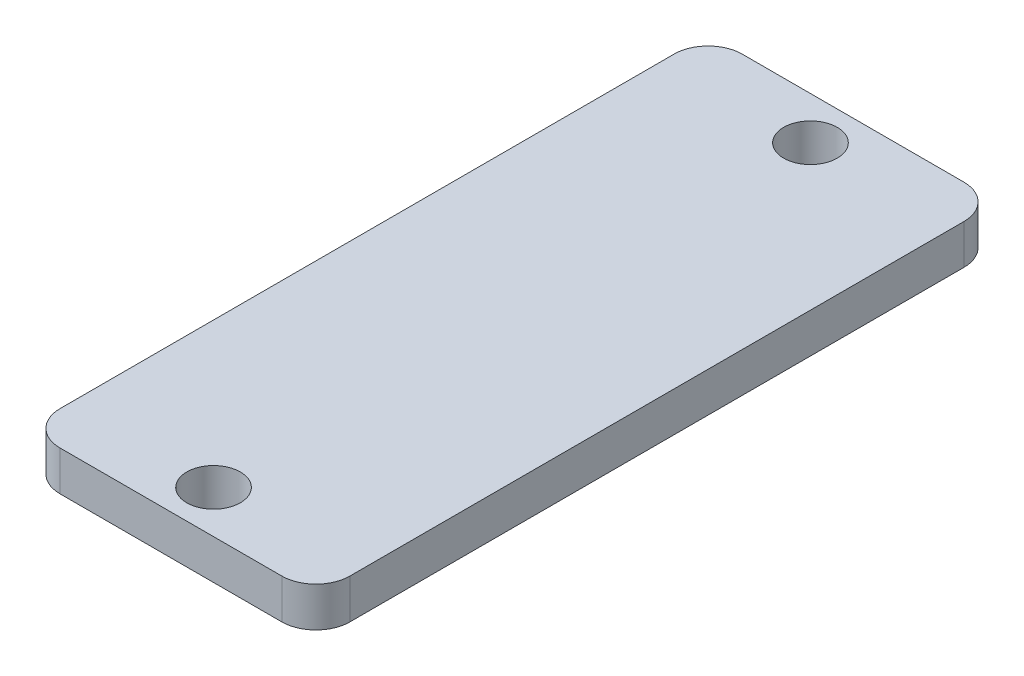
ISO-10303-21;
HEADER;
FILE_DESCRIPTION(('STEP AP214'),'2;1');
FILE_NAME('part.step','',(''),(''),'','','');
FILE_SCHEMA(('AUTOMOTIVE_DESIGN { 1 0 10303 214 1 1 1 1 }'));
ENDSEC;
DATA;
#1=APPLICATION_CONTEXT('core data for automotive mechanical design processes');
#2=APPLICATION_PROTOCOL_DEFINITION('international standard','automotive_design',2000,#1);
#3=PRODUCT_CONTEXT('',#1,'mechanical');
#4=PRODUCT('Part','Part','',(#3));
#5=PRODUCT_RELATED_PRODUCT_CATEGORY('part','',(#4));
#6=PRODUCT_DEFINITION_FORMATION('','',#4);
#7=PRODUCT_DEFINITION_CONTEXT('part definition',#1,'design');
#8=PRODUCT_DEFINITION('design','',#6,#7);
#9=PRODUCT_DEFINITION_SHAPE('','',#8);
#10=(LENGTH_UNIT() NAMED_UNIT(*) SI_UNIT(.MILLI.,.METRE.));
#11=(NAMED_UNIT(*) PLANE_ANGLE_UNIT() SI_UNIT($,.RADIAN.));
#12=(NAMED_UNIT(*) SI_UNIT($,.STERADIAN.) SOLID_ANGLE_UNIT());
#13=UNCERTAINTY_MEASURE_WITH_UNIT(LENGTH_MEASURE(1.E-05),#10,'distance_accuracy_value','');
#14=(GEOMETRIC_REPRESENTATION_CONTEXT(3) GLOBAL_UNCERTAINTY_ASSIGNED_CONTEXT((#13)) GLOBAL_UNIT_ASSIGNED_CONTEXT((#10,
#11,#12)) REPRESENTATION_CONTEXT('',''));
#15=CARTESIAN_POINT('',(0.,0.,0.));
#16=DIRECTION('',(0.,0.,1.));
#17=DIRECTION('',(1.,0.,0.));
#18=AXIS2_PLACEMENT_3D('',#15,#16,#17);
#19=CARTESIAN_POINT('',(0.,2.9591,0.));
#20=DIRECTION('',(0.,-1.,0.));
#21=DIRECTION('',(0.,0.,-1.));
#22=AXIS2_PLACEMENT_3D('',#19,#20,#21);
#23=PLANE('',#22);
#24=CARTESIAN_POINT('',(0.,2.9591,-22.225));
#25=DIRECTION('',(0.,1.,0.));
#26=DIRECTION('',(0.,0.,1.));
#27=AXIS2_PLACEMENT_3D('',#24,#25,#26);
#28=CIRCLE('',#27,1.9939);
#29=CARTESIAN_POINT('',(0.,2.9591,-20.2311));
#30=VERTEX_POINT('',#29);
#31=EDGE_CURVE('E132',#30,#30,#28,.T.);
#32=ORIENTED_EDGE('',*,*,#31,.F.);
#33=EDGE_LOOP('',(#32));
#34=FACE_BOUND('',#33,.T.);
#35=DIRECTION('',(0.,0.,-1.));
#36=VECTOR('',#35,1.);
#37=CARTESIAN_POINT('',(10.795,2.9591,25.4));
#38=LINE('',#37,#36);
#39=CARTESIAN_POINT('',(10.795,2.9591,22.86));
#40=VERTEX_POINT('',#39);
#41=CARTESIAN_POINT('',(10.795,2.9591,-22.86));
#42=VERTEX_POINT('',#41);
#43=EDGE_CURVE('E137',#40,#42,#38,.T.);
#44=ORIENTED_EDGE('',*,*,#43,.T.);
#45=CARTESIAN_POINT('',(8.255,2.9591,-22.86));
#46=DIRECTION('',(0.,-1.,0.));
#47=DIRECTION('',(0.,0.,-1.));
#48=AXIS2_PLACEMENT_3D('',#45,#46,#47);
#49=CIRCLE('',#48,2.54);
#50=CARTESIAN_POINT('',(8.255,2.9591,-25.4));
#51=VERTEX_POINT('',#50);
#52=EDGE_CURVE('E152',#42,#51,#49,.F.);
#53=ORIENTED_EDGE('',*,*,#52,.T.);
#54=DIRECTION('',(-1.,0.,0.));
#55=VECTOR('',#54,1.);
#56=CARTESIAN_POINT('',(-10.795,2.9591,-25.4));
#57=LINE('',#56,#55);
#58=CARTESIAN_POINT('',(-8.255,2.9591,-25.4));
#59=VERTEX_POINT('',#58);
#60=EDGE_CURVE('E119',#51,#59,#57,.T.);
#61=ORIENTED_EDGE('',*,*,#60,.T.);
#62=CARTESIAN_POINT('',(-8.255,2.9591,-22.86));
#63=DIRECTION('',(0.,-1.,0.));
#64=DIRECTION('',(0.,0.,-1.));
#65=AXIS2_PLACEMENT_3D('',#62,#63,#64);
#66=CIRCLE('',#65,2.54);
#67=CARTESIAN_POINT('',(-10.795,2.9591,-22.86));
#68=VERTEX_POINT('',#67);
#69=EDGE_CURVE('E150',#59,#68,#66,.F.);
#70=ORIENTED_EDGE('',*,*,#69,.T.);
#71=DIRECTION('',(0.,0.,1.));
#72=VECTOR('',#71,1.);
#73=CARTESIAN_POINT('',(-10.795,2.9591,25.4));
#74=LINE('',#73,#72);
#75=CARTESIAN_POINT('',(-10.795,2.9591,22.86));
#76=VERTEX_POINT('',#75);
#77=EDGE_CURVE('E163',#68,#76,#74,.T.);
#78=ORIENTED_EDGE('',*,*,#77,.T.);
#79=CARTESIAN_POINT('',(-8.255,2.9591,22.86));
#80=DIRECTION('',(0.,-1.,0.));
#81=DIRECTION('',(0.,0.,-1.));
#82=AXIS2_PLACEMENT_3D('',#79,#80,#81);
#83=CIRCLE('',#82,2.54);
#84=CARTESIAN_POINT('',(-8.255,2.9591,25.4));
#85=VERTEX_POINT('',#84);
#86=EDGE_CURVE('E54',#76,#85,#83,.F.);
#87=ORIENTED_EDGE('',*,*,#86,.T.);
#88=DIRECTION('',(1.,0.,0.));
#89=VECTOR('',#88,1.);
#90=CARTESIAN_POINT('',(-10.795,2.9591,25.4));
#91=LINE('',#90,#89);
#92=CARTESIAN_POINT('',(8.255,2.9591,25.4));
#93=VERTEX_POINT('',#92);
#94=EDGE_CURVE('E138',#85,#93,#91,.T.);
#95=ORIENTED_EDGE('',*,*,#94,.T.);
#96=CARTESIAN_POINT('',(8.255,2.9591,22.86));
#97=DIRECTION('',(0.,-1.,0.));
#98=DIRECTION('',(0.,0.,-1.));
#99=AXIS2_PLACEMENT_3D('',#96,#97,#98);
#100=CIRCLE('',#99,2.54);
#101=EDGE_CURVE('E147',#93,#40,#100,.F.);
#102=ORIENTED_EDGE('',*,*,#101,.T.);
#103=EDGE_LOOP('',(#44,#53,#61,#70,#78,#87,#95,#102));
#104=FACE_BOUND('',#103,.T.);
#105=CARTESIAN_POINT('',(0.,2.9591,22.225));
#106=DIRECTION('',(0.,1.,0.));
#107=DIRECTION('',(0.,0.,1.));
#108=AXIS2_PLACEMENT_3D('',#105,#106,#107);
#109=CIRCLE('',#108,1.9939);
#110=CARTESIAN_POINT('',(0.,2.9591,24.2189));
#111=VERTEX_POINT('',#110);
#112=EDGE_CURVE('E180',#111,#111,#109,.T.);
#113=ORIENTED_EDGE('',*,*,#112,.F.);
#114=EDGE_LOOP('',(#113));
#115=FACE_BOUND('',#114,.T.);
#116=ADVANCED_FACE('F33',(#34,#104,#115),#23,.F.);
#117=CARTESIAN_POINT('',(0.,0.,0.));
#118=DIRECTION('',(0.,-1.,0.));
#119=DIRECTION('',(0.,0.,-1.));
#120=AXIS2_PLACEMENT_3D('',#117,#118,#119);
#121=PLANE('',#120);
#122=CARTESIAN_POINT('',(0.,0.,-22.225));
#123=DIRECTION('',(0.,1.,0.));
#124=DIRECTION('',(0.,0.,1.));
#125=AXIS2_PLACEMENT_3D('',#122,#123,#124);
#126=CIRCLE('',#125,1.9939);
#127=CARTESIAN_POINT('',(0.,0.,-20.2311));
#128=VERTEX_POINT('',#127);
#129=EDGE_CURVE('E177',#128,#128,#126,.T.);
#130=ORIENTED_EDGE('',*,*,#129,.T.);
#131=EDGE_LOOP('',(#130));
#132=FACE_BOUND('',#131,.T.);
#133=DIRECTION('',(-1.,0.,0.));
#134=VECTOR('',#133,1.);
#135=CARTESIAN_POINT('',(-10.795,0.,-25.4));
#136=LINE('',#135,#134);
#137=CARTESIAN_POINT('',(8.255,0.,-25.4));
#138=VERTEX_POINT('',#137);
#139=CARTESIAN_POINT('',(-8.255,0.,-25.4));
#140=VERTEX_POINT('',#139);
#141=EDGE_CURVE('E116',#138,#140,#136,.T.);
#142=ORIENTED_EDGE('',*,*,#141,.F.);
#143=CARTESIAN_POINT('',(8.255,0.,-22.86));
#144=DIRECTION('',(0.,-1.,0.));
#145=DIRECTION('',(0.,0.,-1.));
#146=AXIS2_PLACEMENT_3D('',#143,#144,#145);
#147=CIRCLE('',#146,2.54);
#148=CARTESIAN_POINT('',(10.795,0.,-22.86));
#149=VERTEX_POINT('',#148);
#150=EDGE_CURVE('E99',#138,#149,#147,.T.);
#151=ORIENTED_EDGE('',*,*,#150,.T.);
#152=DIRECTION('',(0.,0.,-1.));
#153=VECTOR('',#152,1.);
#154=CARTESIAN_POINT('',(10.795,0.,25.4));
#155=LINE('',#154,#153);
#156=CARTESIAN_POINT('',(10.795,0.,22.86));
#157=VERTEX_POINT('',#156);
#158=EDGE_CURVE('E127',#157,#149,#155,.T.);
#159=ORIENTED_EDGE('',*,*,#158,.F.);
#160=CARTESIAN_POINT('',(8.255,0.,22.86));
#161=DIRECTION('',(0.,-1.,0.));
#162=DIRECTION('',(0.,0.,-1.));
#163=AXIS2_PLACEMENT_3D('',#160,#161,#162);
#164=CIRCLE('',#163,2.54);
#165=CARTESIAN_POINT('',(8.255,0.,25.4));
#166=VERTEX_POINT('',#165);
#167=EDGE_CURVE('E120',#157,#166,#164,.T.);
#168=ORIENTED_EDGE('',*,*,#167,.T.);
#169=DIRECTION('',(1.,0.,0.));
#170=VECTOR('',#169,1.);
#171=CARTESIAN_POINT('',(-10.795,0.,25.4));
#172=LINE('',#171,#170);
#173=CARTESIAN_POINT('',(-8.255,0.,25.4));
#174=VERTEX_POINT('',#173);
#175=EDGE_CURVE('E130',#174,#166,#172,.T.);
#176=ORIENTED_EDGE('',*,*,#175,.F.);
#177=CARTESIAN_POINT('',(-8.255,0.,22.86));
#178=DIRECTION('',(0.,-1.,0.));
#179=DIRECTION('',(0.,0.,-1.));
#180=AXIS2_PLACEMENT_3D('',#177,#178,#179);
#181=CIRCLE('',#180,2.54);
#182=CARTESIAN_POINT('',(-10.795,0.,22.86));
#183=VERTEX_POINT('',#182);
#184=EDGE_CURVE('E141',#174,#183,#181,.T.);
#185=ORIENTED_EDGE('',*,*,#184,.T.);
#186=DIRECTION('',(0.,0.,1.));
#187=VECTOR('',#186,1.);
#188=CARTESIAN_POINT('',(-10.795,0.,25.4));
#189=LINE('',#188,#187);
#190=CARTESIAN_POINT('',(-10.795,0.,-22.86));
#191=VERTEX_POINT('',#190);
#192=EDGE_CURVE('E126',#191,#183,#189,.T.);
#193=ORIENTED_EDGE('',*,*,#192,.F.);
#194=CARTESIAN_POINT('',(-8.255,0.,-22.86));
#195=DIRECTION('',(0.,-1.,0.));
#196=DIRECTION('',(0.,0.,-1.));
#197=AXIS2_PLACEMENT_3D('',#194,#195,#196);
#198=CIRCLE('',#197,2.54);
#199=EDGE_CURVE('E110',#191,#140,#198,.T.);
#200=ORIENTED_EDGE('',*,*,#199,.T.);
#201=EDGE_LOOP('',(#142,#151,#159,#168,#176,#185,#193,#200));
#202=FACE_BOUND('',#201,.T.);
#203=CARTESIAN_POINT('',(0.,0.,22.225));
#204=DIRECTION('',(0.,1.,0.));
#205=DIRECTION('',(0.,0.,1.));
#206=AXIS2_PLACEMENT_3D('',#203,#204,#205);
#207=CIRCLE('',#206,1.9939);
#208=CARTESIAN_POINT('',(0.,0.,24.2189));
#209=VERTEX_POINT('',#208);
#210=EDGE_CURVE('E183',#209,#209,#207,.T.);
#211=ORIENTED_EDGE('',*,*,#210,.T.);
#212=EDGE_LOOP('',(#211));
#213=FACE_BOUND('',#212,.T.);
#214=ADVANCED_FACE('F123',(#132,#202,#213),#121,.T.);
#215=CARTESIAN_POINT('',(10.795,2.9591,25.4));
#216=DIRECTION('',(-1.,0.,0.));
#217=DIRECTION('',(0.,0.,1.));
#218=AXIS2_PLACEMENT_3D('',#215,#216,#217);
#219=PLANE('',#218);
#220=ORIENTED_EDGE('',*,*,#158,.T.);
#221=DIRECTION('',(0.,-1.,0.));
#222=VECTOR('',#221,1.);
#223=CARTESIAN_POINT('',(10.795,2.9591,-22.86));
#224=LINE('',#223,#222);
#225=EDGE_CURVE('E104',#149,#42,#224,.F.);
#226=ORIENTED_EDGE('',*,*,#225,.T.);
#227=ORIENTED_EDGE('',*,*,#43,.F.);
#228=DIRECTION('',(0.,-1.,0.));
#229=VECTOR('',#228,1.);
#230=CARTESIAN_POINT('',(10.795,2.9591,22.86));
#231=LINE('',#230,#229);
#232=EDGE_CURVE('E109',#40,#157,#231,.T.);
#233=ORIENTED_EDGE('',*,*,#232,.T.);
#234=EDGE_LOOP('',(#220,#226,#227,#233));
#235=FACE_BOUND('',#234,.T.);
#236=ADVANCED_FACE('F198',(#235),#219,.F.);
#237=CARTESIAN_POINT('',(-10.795,2.9591,-25.4));
#238=DIRECTION('',(0.,0.,1.));
#239=DIRECTION('',(1.,0.,0.));
#240=AXIS2_PLACEMENT_3D('',#237,#238,#239);
#241=PLANE('',#240);
#242=ORIENTED_EDGE('',*,*,#60,.F.);
#243=DIRECTION('',(0.,-1.,0.));
#244=VECTOR('',#243,1.);
#245=CARTESIAN_POINT('',(8.255,2.9591,-25.4));
#246=LINE('',#245,#244);
#247=EDGE_CURVE('E103',#51,#138,#246,.T.);
#248=ORIENTED_EDGE('',*,*,#247,.T.);
#249=ORIENTED_EDGE('',*,*,#141,.T.);
#250=DIRECTION('',(0.,-1.,0.));
#251=VECTOR('',#250,1.);
#252=CARTESIAN_POINT('',(-8.255,2.9591,-25.4));
#253=LINE('',#252,#251);
#254=EDGE_CURVE('E121',#140,#59,#253,.F.);
#255=ORIENTED_EDGE('',*,*,#254,.T.);
#256=EDGE_LOOP('',(#242,#248,#249,#255));
#257=FACE_BOUND('',#256,.T.);
#258=ADVANCED_FACE('F115',(#257),#241,.F.);
#259=CARTESIAN_POINT('',(-10.795,2.9591,25.4));
#260=DIRECTION('',(1.,0.,0.));
#261=DIRECTION('',(0.,0.,-1.));
#262=AXIS2_PLACEMENT_3D('',#259,#260,#261);
#263=PLANE('',#262);
#264=ORIENTED_EDGE('',*,*,#77,.F.);
#265=DIRECTION('',(0.,-1.,0.));
#266=VECTOR('',#265,1.);
#267=CARTESIAN_POINT('',(-10.795,2.9591,-22.86));
#268=LINE('',#267,#266);
#269=EDGE_CURVE('E156',#68,#191,#268,.T.);
#270=ORIENTED_EDGE('',*,*,#269,.T.);
#271=ORIENTED_EDGE('',*,*,#192,.T.);
#272=DIRECTION('',(0.,-1.,0.));
#273=VECTOR('',#272,1.);
#274=CARTESIAN_POINT('',(-10.795,2.9591,22.86));
#275=LINE('',#274,#273);
#276=EDGE_CURVE('E154',#183,#76,#275,.F.);
#277=ORIENTED_EDGE('',*,*,#276,.T.);
#278=EDGE_LOOP('',(#264,#270,#271,#277));
#279=FACE_BOUND('',#278,.T.);
#280=ADVANCED_FACE('F161',(#279),#263,.F.);
#281=CARTESIAN_POINT('',(-10.795,2.9591,25.4));
#282=DIRECTION('',(0.,0.,-1.));
#283=DIRECTION('',(-1.,0.,0.));
#284=AXIS2_PLACEMENT_3D('',#281,#282,#283);
#285=PLANE('',#284);
#286=ORIENTED_EDGE('',*,*,#94,.F.);
#287=DIRECTION('',(0.,-1.,0.));
#288=VECTOR('',#287,1.);
#289=CARTESIAN_POINT('',(-8.255,2.9591,25.4));
#290=LINE('',#289,#288);
#291=EDGE_CURVE('E11',#85,#174,#290,.T.);
#292=ORIENTED_EDGE('',*,*,#291,.T.);
#293=ORIENTED_EDGE('',*,*,#175,.T.);
#294=DIRECTION('',(0.,-1.,0.));
#295=VECTOR('',#294,1.);
#296=CARTESIAN_POINT('',(8.255,2.9591,25.4));
#297=LINE('',#296,#295);
#298=EDGE_CURVE('E41',#166,#93,#297,.F.);
#299=ORIENTED_EDGE('',*,*,#298,.T.);
#300=EDGE_LOOP('',(#286,#292,#293,#299));
#301=FACE_BOUND('',#300,.T.);
#302=ADVANCED_FACE('F170',(#301),#285,.F.);
#303=CARTESIAN_POINT('',(0.,2.9591,-22.225));
#304=DIRECTION('',(0.,-1.,0.));
#305=DIRECTION('',(0.,0.,-1.));
#306=AXIS2_PLACEMENT_3D('',#303,#304,#305);
#307=CYLINDRICAL_SURFACE('',#306,1.9939);
#308=ORIENTED_EDGE('',*,*,#31,.T.);
#309=EDGE_LOOP('',(#308));
#310=FACE_BOUND('',#309,.T.);
#311=ORIENTED_EDGE('',*,*,#129,.F.);
#312=EDGE_LOOP('',(#311));
#313=FACE_BOUND('',#312,.T.);
#314=ADVANCED_FACE('F203',(#310,#313),#307,.F.);
#315=CARTESIAN_POINT('',(0.,2.9591,22.225));
#316=DIRECTION('',(0.,-1.,0.));
#317=DIRECTION('',(0.,0.,-1.));
#318=AXIS2_PLACEMENT_3D('',#315,#316,#317);
#319=CYLINDRICAL_SURFACE('',#318,1.9939);
#320=ORIENTED_EDGE('',*,*,#112,.T.);
#321=EDGE_LOOP('',(#320));
#322=FACE_BOUND('',#321,.T.);
#323=ORIENTED_EDGE('',*,*,#210,.F.);
#324=EDGE_LOOP('',(#323));
#325=FACE_BOUND('',#324,.T.);
#326=ADVANCED_FACE('F189',(#322,#325),#319,.F.);
#327=CARTESIAN_POINT('',(8.255,2.9591,-22.86));
#328=DIRECTION('',(0.,-1.,0.));
#329=DIRECTION('',(0.,0.,-1.));
#330=AXIS2_PLACEMENT_3D('',#327,#328,#329);
#331=CYLINDRICAL_SURFACE('',#330,2.54);
#332=ORIENTED_EDGE('',*,*,#52,.F.);
#333=ORIENTED_EDGE('',*,*,#225,.F.);
#334=ORIENTED_EDGE('',*,*,#150,.F.);
#335=ORIENTED_EDGE('',*,*,#247,.F.);
#336=EDGE_LOOP('',(#332,#333,#334,#335));
#337=FACE_BOUND('',#336,.T.);
#338=ADVANCED_FACE('F102',(#337),#331,.T.);
#339=CARTESIAN_POINT('',(-8.255,2.9591,-22.86));
#340=DIRECTION('',(0.,-1.,0.));
#341=DIRECTION('',(0.,0.,-1.));
#342=AXIS2_PLACEMENT_3D('',#339,#340,#341);
#343=CYLINDRICAL_SURFACE('',#342,2.54);
#344=ORIENTED_EDGE('',*,*,#69,.F.);
#345=ORIENTED_EDGE('',*,*,#254,.F.);
#346=ORIENTED_EDGE('',*,*,#199,.F.);
#347=ORIENTED_EDGE('',*,*,#269,.F.);
#348=EDGE_LOOP('',(#344,#345,#346,#347));
#349=FACE_BOUND('',#348,.T.);
#350=ADVANCED_FACE('F217',(#349),#343,.T.);
#351=CARTESIAN_POINT('',(-8.255,2.9591,22.86));
#352=DIRECTION('',(0.,-1.,0.));
#353=DIRECTION('',(0.,0.,-1.));
#354=AXIS2_PLACEMENT_3D('',#351,#352,#353);
#355=CYLINDRICAL_SURFACE('',#354,2.54);
#356=ORIENTED_EDGE('',*,*,#86,.F.);
#357=ORIENTED_EDGE('',*,*,#276,.F.);
#358=ORIENTED_EDGE('',*,*,#184,.F.);
#359=ORIENTED_EDGE('',*,*,#291,.F.);
#360=EDGE_LOOP('',(#356,#357,#358,#359));
#361=FACE_BOUND('',#360,.T.);
#362=ADVANCED_FACE('F169',(#361),#355,.T.);
#363=CARTESIAN_POINT('',(8.255,2.9591,22.86));
#364=DIRECTION('',(0.,-1.,0.));
#365=DIRECTION('',(0.,0.,-1.));
#366=AXIS2_PLACEMENT_3D('',#363,#364,#365);
#367=CYLINDRICAL_SURFACE('',#366,2.54);
#368=ORIENTED_EDGE('',*,*,#101,.F.);
#369=ORIENTED_EDGE('',*,*,#298,.F.);
#370=ORIENTED_EDGE('',*,*,#167,.F.);
#371=ORIENTED_EDGE('',*,*,#232,.F.);
#372=EDGE_LOOP('',(#368,#369,#370,#371));
#373=FACE_BOUND('',#372,.T.);
#374=ADVANCED_FACE('F35',(#373),#367,.T.);
#375=CLOSED_SHELL('',(#116,#214,#236,#258,#280,#302,#314,#326,#338,#350,#362,#374));
#376=MANIFOLD_SOLID_BREP('B2',#375);
#377=ADVANCED_BREP_SHAPE_REPRESENTATION('',(#18,#376),#14);
#378=SHAPE_DEFINITION_REPRESENTATION(#9,#377);
ENDSEC;
END-ISO-10303-21;
